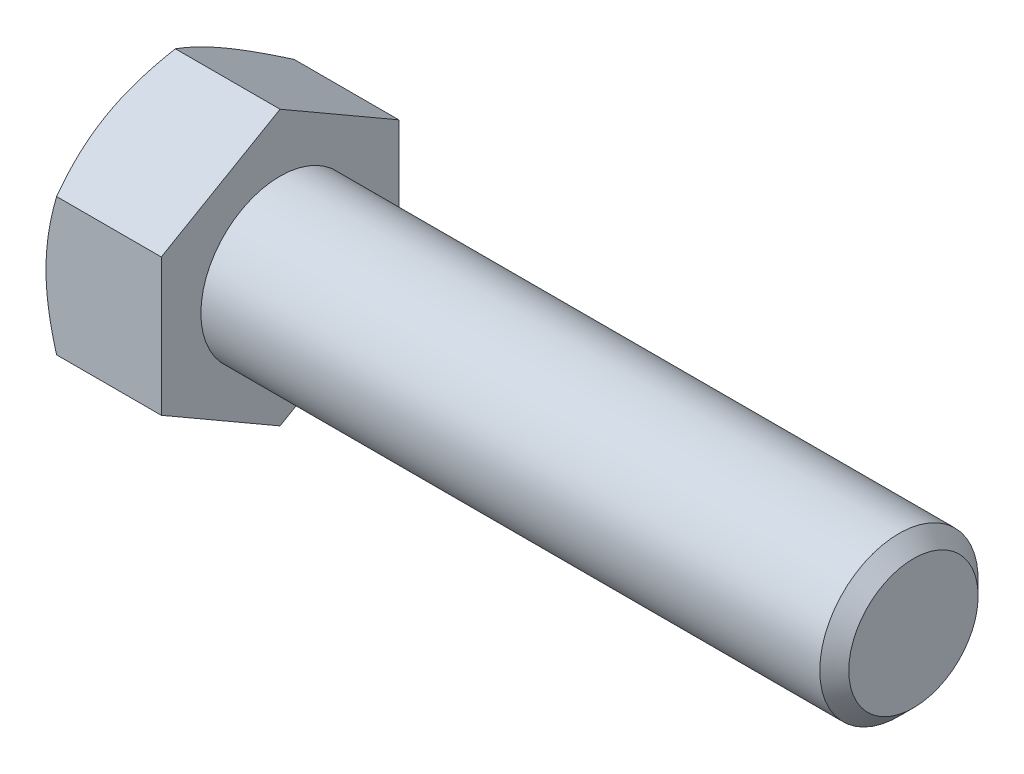
ISO-10303-21;
HEADER;
FILE_DESCRIPTION(('STEP AP214'),'2;1');
FILE_NAME('part.step','',(''),(''),'','','');
FILE_SCHEMA(('AUTOMOTIVE_DESIGN { 1 0 10303 214 1 1 1 1 }'));
ENDSEC;
DATA;
#1=APPLICATION_CONTEXT('core data for automotive mechanical design processes');
#2=APPLICATION_PROTOCOL_DEFINITION('international standard','automotive_design',2000,#1);
#3=PRODUCT_CONTEXT('',#1,'mechanical');
#4=PRODUCT('Part','Part','',(#3));
#5=PRODUCT_RELATED_PRODUCT_CATEGORY('part','',(#4));
#6=PRODUCT_DEFINITION_FORMATION('','',#4);
#7=PRODUCT_DEFINITION_CONTEXT('part definition',#1,'design');
#8=PRODUCT_DEFINITION('design','',#6,#7);
#9=PRODUCT_DEFINITION_SHAPE('','',#8);
#10=(LENGTH_UNIT() NAMED_UNIT(*) SI_UNIT(.MILLI.,.METRE.));
#11=(NAMED_UNIT(*) PLANE_ANGLE_UNIT() SI_UNIT($,.RADIAN.));
#12=(NAMED_UNIT(*) SI_UNIT($,.STERADIAN.) SOLID_ANGLE_UNIT());
#13=UNCERTAINTY_MEASURE_WITH_UNIT(LENGTH_MEASURE(1.E-05),#10,'distance_accuracy_value','');
#14=(GEOMETRIC_REPRESENTATION_CONTEXT(3) GLOBAL_UNCERTAINTY_ASSIGNED_CONTEXT((#13)) GLOBAL_UNIT_ASSIGNED_CONTEXT((#10,
#11,#12)) REPRESENTATION_CONTEXT('',''));
#15=CARTESIAN_POINT('',(0.,0.,0.));
#16=DIRECTION('',(0.,0.,1.));
#17=DIRECTION('',(1.,0.,0.));
#18=AXIS2_PLACEMENT_3D('',#15,#16,#17);
#19=CARTESIAN_POINT('',(9.2456,5.49926131403118,-9.525));
#20=DIRECTION('',(0.,-0.866025403784438,0.5));
#21=DIRECTION('',(0.,-0.5,-0.866025403784438));
#22=AXIS2_PLACEMENT_3D('',#19,#20,#21);
#23=PLANE('',#22);
#24=CARTESIAN_POINT('',(0.850805353685339,10.9986380981162,0.000199999999999971));
#25=CARTESIAN_POINT('',(0.781023201247654,10.8777523132173,-0.209180321357812));
#26=CARTESIAN_POINT('',(0.714408233957875,10.7564158029679,-0.419341321922841));
#27=CARTESIAN_POINT('',(0.588391469790024,10.5127697532954,-0.841348659019071));
#28=CARTESIAN_POINT('',(0.528992045309774,10.3904599078574,-1.05319552558363));
#29=CARTESIAN_POINT('',(0.362766604707593,10.0215595864394,-1.69214962520807));
#30=CARTESIAN_POINT('',(0.268218329918824,9.77351282584137,-2.12177921721667));
#31=CARTESIAN_POINT('',(0.15735162884543,9.40232220358294,-2.76470023426138));
#32=CARTESIAN_POINT('',(0.125769866148953,9.28028730086356,-2.97607088606807));
#33=CARTESIAN_POINT('',(0.0728092531292027,9.03565248016183,-3.39979082482396));
#34=CARTESIAN_POINT('',(0.0514305991810311,8.91305255135051,-3.61214013052951));
#35=CARTESIAN_POINT('',(0.01942397667248,8.66764818787802,-4.03719295646296));
#36=CARTESIAN_POINT('',(0.00878323258549872,8.54484417077186,-4.24989575346438));
#37=CARTESIAN_POINT('',(-0.00152146504907749,8.29912270270345,-4.67549782066928));
#38=CARTESIAN_POINT('',(-0.00118575773535236,8.17620525536319,-4.88839708459929));
#39=CARTESIAN_POINT('',(0.0096988402317776,7.94640807689151,-5.28641747314822));
#40=CARTESIAN_POINT('',(0.0189199445075648,7.83951212670956,-5.4715666899867));
#41=CARTESIAN_POINT('',(0.0454848010115631,7.62597023317657,-5.84143209913029));
#42=CARTESIAN_POINT('',(0.0628291278252528,7.5193243080471,-6.02614825987472));
#43=CARTESIAN_POINT('',(0.126636878025748,7.19979976097279,-6.57958100967286));
#44=CARTESIAN_POINT('',(0.184867121471558,6.98748672019118,-6.94731798341605));
#45=CARTESIAN_POINT('',(0.330443291970776,6.56060850831896,-7.68669273502289));
#46=CARTESIAN_POINT('',(0.418406296346452,6.3460978161353,-8.05823615265175));
#47=CARTESIAN_POINT('',(0.618045797355989,5.92027529884848,-8.79578238759941));
#48=CARTESIAN_POINT('',(0.729675405460148,5.70895802095901,-9.16179464942111));
#49=CARTESIAN_POINT('',(0.850805353685331,5.49914584397734,-9.5252));
#50=B_SPLINE_CURVE_WITH_KNOTS('',3,(#24,#25,#26,#27,#28,#29,#30,#31,#32,#33,#34,#35,#36,#37,#38,
#39,#40,#41,#42,#43,#44,#45,#46,#47,#48,#49),.UNSPECIFIED.,.F.,.F.,(4,2,2,2,2,2,2,2,2,2,2,2,4),
(0.,0.754861746958003,1.50997101692212,3.02340406075151,3.76154608748042,4.49970232035707,
5.23697928598072,5.97423347202913,6.61604550518408,7.25790294292824,8.54252993638602,
9.85564695316764,11.1661863217647),.UNSPECIFIED.);
#51=CARTESIAN_POINT('',(0.850738685968814,10.9985226280624,0.));
#52=VERTEX_POINT('',#51);
#53=CARTESIAN_POINT('',(0.,8.24889197104677,-4.7625));
#54=VERTEX_POINT('',#53);
#55=EDGE_CURVE('E33',#52,#54,#50,.T.);
#56=ORIENTED_EDGE('',*,*,#55,.F.);
#57=DIRECTION('',(-1.,0.,0.));
#58=VECTOR('',#57,1.);
#59=CARTESIAN_POINT('',(9.2456,10.9985226280624,0.));
#60=LINE('',#59,#58);
#61=CARTESIAN_POINT('',(9.2456,10.9985226280624,0.));
#62=VERTEX_POINT('',#61);
#63=EDGE_CURVE('E129',#62,#52,#60,.T.);
#64=ORIENTED_EDGE('',*,*,#63,.F.);
#65=DIRECTION('',(0.,0.5,0.866025403784438));
#66=VECTOR('',#65,1.);
#67=CARTESIAN_POINT('',(9.2456,5.49926131403118,-9.525));
#68=LINE('',#67,#66);
#69=CARTESIAN_POINT('',(9.2456,5.49926131403118,-9.525));
#70=VERTEX_POINT('',#69);
#71=EDGE_CURVE('E214',#70,#62,#68,.T.);
#72=ORIENTED_EDGE('',*,*,#71,.F.);
#73=DIRECTION('',(-1.,0.,0.));
#74=VECTOR('',#73,1.);
#75=CARTESIAN_POINT('',(9.2456,5.49926131403118,-9.525));
#76=LINE('',#75,#74);
#77=CARTESIAN_POINT('',(0.850738685968808,5.49926131403118,-9.525));
#78=VERTEX_POINT('',#77);
#79=EDGE_CURVE('E117',#70,#78,#76,.T.);
#80=ORIENTED_EDGE('',*,*,#79,.T.);
#81=EDGE_CURVE('E111',#54,#78,#50,.T.);
#82=ORIENTED_EDGE('',*,*,#81,.F.);
#83=EDGE_LOOP('',(#56,#64,#72,#80,#82));
#84=FACE_BOUND('',#83,.T.);
#85=ADVANCED_FACE('F17',(#84),#23,.F.);
#86=CARTESIAN_POINT('',(9.2456,10.9985226280624,0.));
#87=DIRECTION('',(0.,-0.866025403784438,-0.5));
#88=DIRECTION('',(0.,0.5,-0.866025403784438));
#89=AXIS2_PLACEMENT_3D('',#86,#87,#88);
#90=PLANE('',#89);
#91=CARTESIAN_POINT('',(0.850805353685331,5.49914584397734,9.5252));
#92=CARTESIAN_POINT('',(0.781023201247651,5.62003162887629,9.31581967864219));
#93=CARTESIAN_POINT('',(0.714408233957875,5.74136813912568,9.10565867807716));
#94=CARTESIAN_POINT('',(0.588391469790027,5.98501418879818,8.68365134098093));
#95=CARTESIAN_POINT('',(0.528992045309778,6.10732403423621,8.47180447441637));
#96=CARTESIAN_POINT('',(0.362766604707597,6.47622435565419,7.83285037479193));
#97=CARTESIAN_POINT('',(0.268218329918826,6.72427111625219,7.40322078278333));
#98=CARTESIAN_POINT('',(0.157351628845434,7.09546173851062,6.76029976573862));
#99=CARTESIAN_POINT('',(0.125769866148958,7.21749664123,6.54892911393194));
#100=CARTESIAN_POINT('',(0.0728092531292075,7.46213146193172,6.12520917517604));
#101=CARTESIAN_POINT('',(0.0514305991810352,7.58473139074305,5.91285986947049));
#102=CARTESIAN_POINT('',(0.0194239766724854,7.83013575421554,5.48780704353704));
#103=CARTESIAN_POINT('',(0.00878323258550612,7.9529397713217,5.27510424653562));
#104=CARTESIAN_POINT('',(-0.00152146504907289,8.1986612393901,4.84950217933073));
#105=CARTESIAN_POINT('',(-0.00118575773535251,8.32157868673037,4.63660291540072));
#106=CARTESIAN_POINT('',(0.00969884023177773,8.55137586520205,4.23858252685179));
#107=CARTESIAN_POINT('',(0.0189199445075688,8.658271815384,4.05343331001331));
#108=CARTESIAN_POINT('',(0.0454848010115698,8.87181370891698,3.68356790086972));
#109=CARTESIAN_POINT('',(0.0628291278252584,8.97845963404645,3.49885174012529));
#110=CARTESIAN_POINT('',(0.126636878025752,9.29798418112076,2.94541899032714));
#111=CARTESIAN_POINT('',(0.184867121471563,9.51029722190237,2.57768201658396));
#112=CARTESIAN_POINT('',(0.330443291970782,9.93717543377459,1.83830726497712));
#113=CARTESIAN_POINT('',(0.418406296346458,10.1516861259583,1.46676384734825));
#114=CARTESIAN_POINT('',(0.618045797355995,10.5775086432451,0.729217612400589));
#115=CARTESIAN_POINT('',(0.729675405460155,10.7888259211345,0.363205350578887));
#116=CARTESIAN_POINT('',(0.850805353685338,10.9986380981162,-0.000199999999998291));
#117=B_SPLINE_CURVE_WITH_KNOTS('',3,(#91,#92,#93,#94,#95,#96,#97,#98,#99,#100,#101,#102,#103,
#104,#105,#106,#107,#108,#109,#110,#111,#112,#113,#114,#115,#116),.UNSPECIFIED.,.F.,.F.,(4,2,2,
2,2,2,2,2,2,2,2,2,4),(0.,0.754861746958003,1.50997101692211,3.0234040607515,3.76154608748042,
4.49970232035706,5.23697928598071,5.97423347202912,6.61604550518407,7.25790294292823,
8.54252993638601,9.85564695316763,11.1661863217647),.UNSPECIFIED.);
#118=CARTESIAN_POINT('',(0.850738685968807,5.49926131403118,9.525));
#119=VERTEX_POINT('',#118);
#120=CARTESIAN_POINT('',(0.,8.24889197104677,4.7625));
#121=VERTEX_POINT('',#120);
#122=EDGE_CURVE('E40',#119,#121,#117,.T.);
#123=ORIENTED_EDGE('',*,*,#122,.F.);
#124=DIRECTION('',(-1.,0.,0.));
#125=VECTOR('',#124,1.);
#126=CARTESIAN_POINT('',(9.2456,5.49926131403118,9.525));
#127=LINE('',#126,#125);
#128=CARTESIAN_POINT('',(9.2456,5.49926131403118,9.525));
#129=VERTEX_POINT('',#128);
#130=EDGE_CURVE('E127',#129,#119,#127,.T.);
#131=ORIENTED_EDGE('',*,*,#130,.F.);
#132=DIRECTION('',(0.,-0.5,0.866025403784438));
#133=VECTOR('',#132,1.);
#134=CARTESIAN_POINT('',(9.2456,10.9985226280624,0.));
#135=LINE('',#134,#133);
#136=EDGE_CURVE('E212',#62,#129,#135,.T.);
#137=ORIENTED_EDGE('',*,*,#136,.F.);
#138=ORIENTED_EDGE('',*,*,#63,.T.);
#139=EDGE_CURVE('E144',#121,#52,#117,.T.);
#140=ORIENTED_EDGE('',*,*,#139,.F.);
#141=EDGE_LOOP('',(#123,#131,#137,#138,#140));
#142=FACE_BOUND('',#141,.T.);
#143=ADVANCED_FACE('F150',(#142),#90,.F.);
#144=CARTESIAN_POINT('',(9.2456,5.49926131403118,9.525));
#145=DIRECTION('',(0.,0.,-1.));
#146=DIRECTION('',(-1.,0.,0.));
#147=AXIS2_PLACEMENT_3D('',#144,#145,#146);
#148=PLANE('',#147);
#149=CARTESIAN_POINT('',(4.652978620201,-14.7810115366526,9.525));
#150=CARTESIAN_POINT('',(4.55200114697974,-14.5729402848548,9.525));
#151=CARTESIAN_POINT('',(4.451526578525,-14.3646250845143,9.525));
#152=CARTESIAN_POINT('',(4.25169715270385,-13.9474558848886,9.525));
#153=CARTESIAN_POINT('',(4.15234230655459,-13.7386018802315,9.525));
#154=CARTESIAN_POINT('',(3.85610205085237,-13.1110997604408,9.525));
#155=CARTESIAN_POINT('',(3.66107082946322,-12.6915729928092,9.525));
#156=CARTESIAN_POINT('',(3.27608312845876,-11.8474364819289,9.525));
#157=CARTESIAN_POINT('',(3.08615996520331,-11.4228115070931,9.525));
#158=CARTESIAN_POINT('',(2.71407238167634,-10.5701875182868,9.525));
#159=CARTESIAN_POINT('',(2.53190759510788,-10.1421886647409,9.525));
#160=CARTESIAN_POINT('',(2.1717318042123,-9.26840827793763,9.525));
#161=CARTESIAN_POINT('',(1.99403865760543,-8.8224950006504,9.525));
#162=CARTESIAN_POINT('',(1.65207801715253,-7.9254565440483,9.525));
#163=CARTESIAN_POINT('',(1.48781202814777,-7.47433078699668,9.525));
#164=CARTESIAN_POINT('',(1.17701101312695,-6.56698486643263,9.525));
#165=CARTESIAN_POINT('',(1.0304402073799,-6.11077709183235,9.525));
#166=CARTESIAN_POINT('',(0.7597239804624,-5.19183461770946,9.525));
#167=CARTESIAN_POINT('',(0.635571508908769,-4.72910201971935,9.525));
#168=CARTESIAN_POINT('',(0.416296039044827,-3.79927533749825,9.525));
#169=CARTESIAN_POINT('',(0.321019170056998,-3.33221854628569,9.525));
#170=CARTESIAN_POINT('',(0.203895327456021,-2.62737339603034,9.525));
#171=CARTESIAN_POINT('',(0.169151073901595,-2.39169815065083,9.525));
#172=CARTESIAN_POINT('',(0.108940898325769,-1.91917305353183,9.525));
#173=CARTESIAN_POINT('',(0.0834740799106718,-1.68232331751526,9.525));
#174=CARTESIAN_POINT('',(0.0426462139382911,-1.21086692666172,9.525));
#175=CARTESIAN_POINT('',(0.0271575476697088,-0.976271367216098,9.525));
#176=CARTESIAN_POINT('',(0.00611497588533458,-0.506635508477952,9.525));
#177=CARTESIAN_POINT('',(0.000560905150695468,-0.271595216646697,9.525));
#178=CARTESIAN_POINT('',(-0.0004799671317914,0.198511625361329,9.525));
#179=CARTESIAN_POINT('',(0.00403333600034556,0.433578175785724,9.525));
#180=CARTESIAN_POINT('',(0.0230169602197958,0.903311845567765,9.525));
#181=CARTESIAN_POINT('',(0.0374877771856483,1.13797894444949,9.525));
#182=CARTESIAN_POINT('',(0.0838926002328699,1.70156520102241,9.525));
#183=CARTESIAN_POINT('',(0.120529196491428,2.03010533257161,9.525));
#184=CARTESIAN_POINT('',(0.211324091565227,2.68473880457706,9.525));
#185=CARTESIAN_POINT('',(0.265484757377356,3.01083180840528,9.525));
#186=CARTESIAN_POINT('',(0.451380100896851,3.98506326209961,9.525));
#187=CARTESIAN_POINT('',(0.6064950202191,4.62879899939553,9.525));
#188=CARTESIAN_POINT('',(0.875429330956873,5.59158230732313,9.525));
#189=CARTESIAN_POINT('',(0.972405254059027,5.91562142468818,9.525));
#190=CARTESIAN_POINT('',(1.1764087393435,6.56055109397582,9.525));
#191=CARTESIAN_POINT('',(1.28343637307407,6.88144162346874,9.525));
#192=CARTESIAN_POINT('',(1.50582732440541,7.52017825999873,9.525));
#193=CARTESIAN_POINT('',(1.62118794476214,7.83802531476306,9.525));
#194=CARTESIAN_POINT('',(1.85888923263679,8.47108431720178,9.525));
#195=CARTESIAN_POINT('',(1.98122977973552,8.78629631022932,9.525));
#196=CARTESIAN_POINT('',(2.30063477459308,9.5871627431034,9.525));
#197=CARTESIAN_POINT('',(2.50178184900059,10.0711868007296,9.525));
#198=CARTESIAN_POINT('',(2.91473175900993,11.0346830906917,9.525));
#199=CARTESIAN_POINT('',(3.12653548923491,11.5141549368409,9.525));
#200=CARTESIAN_POINT('',(3.55844219486127,12.4695072075479,9.525));
#201=CARTESIAN_POINT('',(3.77854763045354,12.9453865165195,9.525));
#202=CARTESIAN_POINT('',(4.22520690131799,13.8940827737157,9.525));
#203=CARTESIAN_POINT('',(4.45176054207863,14.3668998137873,9.525));
#204=CARTESIAN_POINT('',(4.91030379081788,15.31066754278,9.525));
#205=CARTESIAN_POINT('',(5.14230026383006,15.7816148898186,9.525));
#206=CARTESIAN_POINT('',(5.61043419198851,16.7214473380242,9.525));
#207=CARTESIAN_POINT('',(5.84657167244608,17.190332426564,9.525));
#208=CARTESIAN_POINT('',(6.32217781208354,18.1263065899709,9.525));
#209=CARTESIAN_POINT('',(6.56164589066585,18.5933959601917,9.525));
#210=CARTESIAN_POINT('',(7.04336394052912,19.5261387749102,9.525));
#211=CARTESIAN_POINT('',(7.2856139225859,19.9917922138368,9.525));
#212=CARTESIAN_POINT('',(7.96929589667508,21.2980525732429,9.525));
#213=CARTESIAN_POINT('',(8.41334550528857,22.137289288128,9.525));
#214=CARTESIAN_POINT('',(9.30698696570739,23.81285124024,9.525));
#215=CARTESIAN_POINT('',(9.75657908064913,24.6491763367986,9.525));
#216=CARTESIAN_POINT('',(10.6586387715906,26.3171534675353,9.525));
#217=CARTESIAN_POINT('',(11.111094298492,27.1488120222569,9.525));
#218=CARTESIAN_POINT('',(11.7921739160347,28.394953533384,9.525));
#219=CARTESIAN_POINT('',(12.0195924712892,28.8100962856008,9.525));
#220=CARTESIAN_POINT('',(12.4751463020887,29.6399876727052,9.525));
#221=CARTESIAN_POINT('',(12.7032815766791,30.0547363081167,9.525));
#222=CARTESIAN_POINT('',(12.9317320980145,30.4693112732241,9.525));
#223=B_SPLINE_CURVE_WITH_KNOTS('',3,(#149,#150,#151,#152,#153,#154,#155,#156,#157,#158,#159,
#160,#161,#162,#163,#164,#165,#166,#167,#168,#169,#170,#171,#172,#173,#174,#175,#176,#177,#178,
#179,#180,#181,#182,#183,#184,#185,#186,#187,#188,#189,#190,#191,#192,#193,#194,#195,#196,#197,
#198,#199,#200,#201,#202,#203,#204,#205,#206,#207,#208,#209,#210,#211,#212,#213,#214,#215,#216,
#217,#218,#219,#220,#221,#222),.UNSPECIFIED.,.F.,.F.,(4,2,2,2,2,2,2,2,2,2,2,2,2,2,2,2,2,2,2,2,2,
2,2,2,2,2,2,2,2,2,2,2,2,2,2,2,4),(0.,0.693836530044209,1.38768000463458,2.77557197297935,
4.17100213114403,5.56636633354267,7.00624082823087,8.44627647542749,9.88334978435085,
11.3199703553045,12.748795200913,13.4633089947651,14.177753733363,14.882869257303,
15.5879730545998,16.2930841835603,16.9982304291964,17.9894005549206,18.9807046150987,
20.9643780182785,21.979010564481,22.9936503334043,24.0079631400216,25.0222584527869,
26.5945433127102,28.1669603864419,29.7398471611297,31.3126865395143,32.8876294963396,
34.4625820831342,36.0372634785707,37.6119509756548,40.460336959425,43.3088586981742,
46.1491565485714,47.569213896597,48.9892693539119),.UNSPECIFIED.);
#224=CARTESIAN_POINT('',(0.850738685968817,-5.49926131403121,9.525));
#225=VERTEX_POINT('',#224);
#226=CARTESIAN_POINT('',(0.,0.,9.525));
#227=VERTEX_POINT('',#226);
#228=EDGE_CURVE('E224',#225,#227,#223,.T.);
#229=ORIENTED_EDGE('',*,*,#228,.F.);
#230=DIRECTION('',(-1.,0.,0.));
#231=VECTOR('',#230,1.);
#232=CARTESIAN_POINT('',(9.2456,-5.49926131403121,9.525));
#233=LINE('',#232,#231);
#234=CARTESIAN_POINT('',(9.2456,-5.49926131403121,9.525));
#235=VERTEX_POINT('',#234);
#236=EDGE_CURVE('E119',#235,#225,#233,.T.);
#237=ORIENTED_EDGE('',*,*,#236,.F.);
#238=DIRECTION('',(0.,-1.,0.));
#239=VECTOR('',#238,1.);
#240=CARTESIAN_POINT('',(9.2456,5.49926131403118,9.525));
#241=LINE('',#240,#239);
#242=EDGE_CURVE('E208',#129,#235,#241,.T.);
#243=ORIENTED_EDGE('',*,*,#242,.F.);
#244=ORIENTED_EDGE('',*,*,#130,.T.);
#245=EDGE_CURVE('E166',#227,#119,#223,.T.);
#246=ORIENTED_EDGE('',*,*,#245,.F.);
#247=EDGE_LOOP('',(#229,#237,#243,#244,#246));
#248=FACE_BOUND('',#247,.T.);
#249=ADVANCED_FACE('F230',(#248),#148,.F.);
#250=CARTESIAN_POINT('',(9.2456,-10.9985226280624,0.));
#251=DIRECTION('',(0.,0.866025403784438,-0.5));
#252=DIRECTION('',(0.,0.5,0.866025403784438));
#253=AXIS2_PLACEMENT_3D('',#250,#251,#252);
#254=PLANE('',#253);
#255=CARTESIAN_POINT('',(0.850805353685355,-10.9986380981162,-0.000200000000000202));
#256=CARTESIAN_POINT('',(0.78102320124767,-10.8777523132173,0.209180321357815));
#257=CARTESIAN_POINT('',(0.714408233957891,-10.7564158029679,0.419341321922845));
#258=CARTESIAN_POINT('',(0.58839146979004,-10.5127697532954,0.841348659019077));
#259=CARTESIAN_POINT('',(0.528992045309789,-10.3904599078574,1.05319552558364));
#260=CARTESIAN_POINT('',(0.362766604707608,-10.0215595864394,1.69214962520808));
#261=CARTESIAN_POINT('',(0.268218329918838,-9.77351282584139,2.12177921721669));
#262=CARTESIAN_POINT('',(0.157351628845445,-9.40232220358296,2.76470023426139));
#263=CARTESIAN_POINT('',(0.125769866148968,-9.28028730086358,2.97607088606808));
#264=CARTESIAN_POINT('',(0.0728092531292174,-9.03565248016185,3.39979082482397));
#265=CARTESIAN_POINT('',(0.0514305991810452,-8.91305255135052,3.61214013052952));
#266=CARTESIAN_POINT('',(0.0194239766724941,-8.66764818787804,4.03719295646297));
#267=CARTESIAN_POINT('',(0.00878323258551323,-8.54484417077188,4.2498957534644));
#268=CARTESIAN_POINT('',(-0.00152146504906245,-8.29912270270347,4.67549782066929));
#269=CARTESIAN_POINT('',(-0.00118575773533726,-8.17620525536321,4.8883970845993));
#270=CARTESIAN_POINT('',(0.00969884023179252,-7.94640807689152,5.28641747314823));
#271=CARTESIAN_POINT('',(0.0189199445075795,-7.83951212670958,5.47156668998671));
#272=CARTESIAN_POINT('',(0.0454848010115774,-7.6259702331766,5.8414320991303));
#273=CARTESIAN_POINT('',(0.0628291278252671,-7.51932430804712,6.02614825987473));
#274=CARTESIAN_POINT('',(0.126636878025762,-7.19979976097281,6.57958100967287));
#275=CARTESIAN_POINT('',(0.184867121471572,-6.98748672019121,6.94731798341606));
#276=CARTESIAN_POINT('',(0.330443291970789,-6.56060850831899,7.68669273502289));
#277=CARTESIAN_POINT('',(0.418406296346464,-6.34609781613533,8.05823615265176));
#278=CARTESIAN_POINT('',(0.618045797356,-5.9202752988485,8.79578238759942));
#279=CARTESIAN_POINT('',(0.729675405460159,-5.70895802095904,9.16179464942112));
#280=CARTESIAN_POINT('',(0.850805353685341,-5.49914584397737,9.5252));
#281=B_SPLINE_CURVE_WITH_KNOTS('',3,(#255,#256,#257,#258,#259,#260,#261,#262,#263,#264,#265,
#266,#267,#268,#269,#270,#271,#272,#273,#274,#275,#276,#277,#278,#279,#280),.UNSPECIFIED.,.F.,
.F.,(4,2,2,2,2,2,2,2,2,2,2,2,4),(0.,0.754861746958005,1.50997101692212,3.02340406075152,
3.76154608748043,4.49970232035708,5.23697928598073,5.97423347202915,6.61604550518409,
7.25790294292825,8.54252993638602,9.85564695316764,11.1661863217647),.UNSPECIFIED.);
#282=CARTESIAN_POINT('',(0.850738685968831,-10.9985226280624,0.));
#283=VERTEX_POINT('',#282);
#284=CARTESIAN_POINT('',(0.,-8.24889197104677,4.7625));
#285=VERTEX_POINT('',#284);
#286=EDGE_CURVE('E152',#283,#285,#281,.T.);
#287=ORIENTED_EDGE('',*,*,#286,.F.);
#288=DIRECTION('',(-1.,0.,0.));
#289=VECTOR('',#288,1.);
#290=CARTESIAN_POINT('',(9.2456,-10.9985226280624,0.));
#291=LINE('',#290,#289);
#292=CARTESIAN_POINT('',(9.2456,-10.9985226280624,0.));
#293=VERTEX_POINT('',#292);
#294=EDGE_CURVE('E116',#293,#283,#291,.T.);
#295=ORIENTED_EDGE('',*,*,#294,.F.);
#296=DIRECTION('',(0.,-0.5,-0.866025403784438));
#297=VECTOR('',#296,1.);
#298=CARTESIAN_POINT('',(9.2456,-10.9985226280624,0.));
#299=LINE('',#298,#297);
#300=EDGE_CURVE('E206',#235,#293,#299,.T.);
#301=ORIENTED_EDGE('',*,*,#300,.F.);
#302=ORIENTED_EDGE('',*,*,#236,.T.);
#303=EDGE_CURVE('E154',#285,#225,#281,.T.);
#304=ORIENTED_EDGE('',*,*,#303,.F.);
#305=EDGE_LOOP('',(#287,#295,#301,#302,#304));
#306=FACE_BOUND('',#305,.T.);
#307=ADVANCED_FACE('F202',(#306),#254,.F.);
#308=CARTESIAN_POINT('',(9.2456,-5.4992613140312,-9.525));
#309=DIRECTION('',(0.,0.866025403784438,0.5));
#310=DIRECTION('',(0.,-0.5,0.866025403784438));
#311=AXIS2_PLACEMENT_3D('',#308,#309,#310);
#312=PLANE('',#311);
#313=CARTESIAN_POINT('',(0.850805353685339,-5.49914584397736,-9.5252));
#314=CARTESIAN_POINT('',(0.781023201247656,-5.62003162887631,-9.31581967864218));
#315=CARTESIAN_POINT('',(0.714408233957878,-5.74136813912569,-9.10565867807715));
#316=CARTESIAN_POINT('',(0.588391469790029,-5.9850141887982,-8.68365134098092));
#317=CARTESIAN_POINT('',(0.528992045309779,-6.10732403423622,-8.47180447441636));
#318=CARTESIAN_POINT('',(0.362766604707598,-6.47622435565421,-7.83285037479192));
#319=CARTESIAN_POINT('',(0.268218329918828,-6.72427111625221,-7.40322078278332));
#320=CARTESIAN_POINT('',(0.157351628845436,-7.09546173851063,-6.76029976573861));
#321=CARTESIAN_POINT('',(0.12576986614896,-7.21749664123001,-6.54892911393192));
#322=CARTESIAN_POINT('',(0.0728092531292107,-7.46213146193174,-6.12520917517603));
#323=CARTESIAN_POINT('',(0.0514305991810387,-7.58473139074307,-5.91285986947048));
#324=CARTESIAN_POINT('',(0.0194239766724879,-7.83013575421556,-5.48780704353703));
#325=CARTESIAN_POINT('',(0.00878323258550723,-7.95293977132171,-5.27510424653561));
#326=CARTESIAN_POINT('',(-0.00152146504906597,-8.19866123939013,-4.84950217933071));
#327=CARTESIAN_POINT('',(-0.00118575773533842,-8.3215786867304,-4.63660291540071));
#328=CARTESIAN_POINT('',(0.00969884023179119,-8.55137586520208,-4.23858252685178));
#329=CARTESIAN_POINT('',(0.0189199445075763,-8.65827181538402,-4.0534333100133));
#330=CARTESIAN_POINT('',(0.0454848010115732,-8.871813708917,-3.6835679008697));
#331=CARTESIAN_POINT('',(0.0628291278252637,-8.97845963404647,-3.49885174012527));
#332=CARTESIAN_POINT('',(0.126636878025761,-9.29798418112079,-2.94541899032713));
#333=CARTESIAN_POINT('',(0.184867121471571,-9.51029722190239,-2.57768201658395));
#334=CARTESIAN_POINT('',(0.330443291970789,-9.93717543377461,-1.8383072649771));
#335=CARTESIAN_POINT('',(0.418406296346465,-10.1516861259583,-1.46676384734824));
#336=CARTESIAN_POINT('',(0.618045797356005,-10.5775086432451,-0.72921761240058));
#337=CARTESIAN_POINT('',(0.729675405460167,-10.7888259211346,-0.363205350578882));
#338=CARTESIAN_POINT('',(0.850805353685355,-10.9986380981162,0.000199999999999635));
#339=B_SPLINE_CURVE_WITH_KNOTS('',3,(#313,#314,#315,#316,#317,#318,#319,#320,#321,#322,#323,
#324,#325,#326,#327,#328,#329,#330,#331,#332,#333,#334,#335,#336,#337,#338),.UNSPECIFIED.,.F.,
.F.,(4,2,2,2,2,2,2,2,2,2,2,2,4),(0.,0.754861746958003,1.50997101692212,3.02340406075151,
3.76154608748043,4.49970232035707,5.23697928598073,5.97423347202913,6.61604550518408,
7.25790294292824,8.54252993638602,9.85564695316764,11.1661863217647),.UNSPECIFIED.);
#340=CARTESIAN_POINT('',(0.850738685968814,-5.4992613140312,-9.525));
#341=VERTEX_POINT('',#340);
#342=CARTESIAN_POINT('',(0.,-8.24889197104677,-4.7625));
#343=VERTEX_POINT('',#342);
#344=EDGE_CURVE('E93',#341,#343,#339,.T.);
#345=ORIENTED_EDGE('',*,*,#344,.F.);
#346=DIRECTION('',(-1.,0.,0.));
#347=VECTOR('',#346,1.);
#348=CARTESIAN_POINT('',(9.2456,-5.4992613140312,-9.525));
#349=LINE('',#348,#347);
#350=CARTESIAN_POINT('',(9.2456,-5.4992613140312,-9.525));
#351=VERTEX_POINT('',#350);
#352=EDGE_CURVE('E107',#351,#341,#349,.T.);
#353=ORIENTED_EDGE('',*,*,#352,.F.);
#354=DIRECTION('',(0.,0.5,-0.866025403784438));
#355=VECTOR('',#354,1.);
#356=CARTESIAN_POINT('',(9.2456,-5.4992613140312,-9.525));
#357=LINE('',#356,#355);
#358=EDGE_CURVE('E204',#293,#351,#357,.T.);
#359=ORIENTED_EDGE('',*,*,#358,.F.);
#360=ORIENTED_EDGE('',*,*,#294,.T.);
#361=EDGE_CURVE('E110',#343,#283,#339,.T.);
#362=ORIENTED_EDGE('',*,*,#361,.F.);
#363=EDGE_LOOP('',(#345,#353,#359,#360,#362));
#364=FACE_BOUND('',#363,.T.);
#365=ADVANCED_FACE('F105',(#364),#312,.F.);
#366=CARTESIAN_POINT('',(9.2456,5.49926131403118,-9.525));
#367=DIRECTION('',(0.,0.,1.));
#368=DIRECTION('',(0.,-1.,0.));
#369=AXIS2_PLACEMENT_3D('',#366,#367,#368);
#370=PLANE('',#369);
#371=CARTESIAN_POINT('',(4.65297862037688,-14.781011537015,-9.525));
#372=CARTESIAN_POINT('',(4.55200114715194,-14.5729402852111,-9.525));
#373=CARTESIAN_POINT('',(4.45152657869351,-14.3646250848645,-9.525));
#374=CARTESIAN_POINT('',(4.25169715286501,-13.9474558852266,-9.525));
#375=CARTESIAN_POINT('',(4.15234230671207,-13.7386018805634,-9.525));
#376=CARTESIAN_POINT('',(3.85610205099884,-13.1110997607544,-9.525));
#377=CARTESIAN_POINT('',(3.66107082960237,-12.6915729931106,-9.525));
#378=CARTESIAN_POINT('',(3.27608312858326,-11.8474364822056,-9.525));
#379=CARTESIAN_POINT('',(3.08615996532048,-11.4228115073574,-9.525));
#380=CARTESIAN_POINT('',(2.71407238177897,-10.5701875185262,-9.525));
#381=CARTESIAN_POINT('',(2.53190759520331,-10.1421886649677,-9.525));
#382=CARTESIAN_POINT('',(2.17173180429314,-9.26840827813855,-9.525));
#383=CARTESIAN_POINT('',(1.99403865767891,-8.82249500083789,-9.525));
#384=CARTESIAN_POINT('',(1.65207801721168,-7.92545654420872,-9.525));
#385=CARTESIAN_POINT('',(1.48781202819996,-7.47433078714345,-9.525));
#386=CARTESIAN_POINT('',(1.17701101316588,-6.56698486655185,-9.525));
#387=CARTESIAN_POINT('',(1.03044020741254,-6.11077709193766,-9.525));
#388=CARTESIAN_POINT('',(0.759723980483507,-5.19183461778659,-9.525));
#389=CARTESIAN_POINT('',(0.635571508924628,-4.7291020197822,-9.525));
#390=CARTESIAN_POINT('',(0.416296039050122,-3.79927533752507,-9.525));
#391=CARTESIAN_POINT('',(0.321019170057397,-3.33221854629067,-9.525));
#392=CARTESIAN_POINT('',(0.203895327451555,-2.62737339600217,-9.525));
#393=CARTESIAN_POINT('',(0.16915107389592,-2.39169815061155,-9.525));
#394=CARTESIAN_POINT('',(0.108940898318592,-1.91917305347024,-9.525));
#395=CARTESIAN_POINT('',(0.0834740799032018,-1.68232331744248,-9.525));
#396=CARTESIAN_POINT('',(0.0426462139312217,-1.21086692656677,-9.525));
#397=CARTESIAN_POINT('',(0.0271575476633157,-0.976271367110179,-9.525));
#398=CARTESIAN_POINT('',(0.00611497588125667,-0.506635508350125,-9.525));
#399=CARTESIAN_POINT('',(0.000560905148256367,-0.271595216507931,-9.525));
#400=CARTESIAN_POINT('',(-0.000479967130014341,0.198511625521891,-9.525));
#401=CARTESIAN_POINT('',(0.00403333600470016,0.43357817595714,-9.525));
#402=CARTESIAN_POINT('',(0.0230169602301712,0.903311845760749,-9.525));
#403=CARTESIAN_POINT('',(0.037487777199467,1.13797894465318,-9.525));
#404=CARTESIAN_POINT('',(0.0838926002551648,1.70156520124285,-9.525));
#405=CARTESIAN_POINT('',(0.120529196518619,2.03010533279804,-9.525));
#406=CARTESIAN_POINT('',(0.211324091602473,2.68473880481518,-9.525));
#407=CARTESIAN_POINT('',(0.265484757419762,3.01083180864913,-9.525));
#408=CARTESIAN_POINT('',(0.451380100954848,3.98506326236031,-9.525));
#409=CARTESIAN_POINT('',(0.606495020287634,4.62879899966704,-9.525));
#410=CARTESIAN_POINT('',(0.875429331040971,5.59158230761081,-9.525));
#411=CARTESIAN_POINT('',(0.97240525414835,5.91562142498137,-9.525));
#412=CARTESIAN_POINT('',(1.17640873944312,6.56055109427995,-9.525));
#413=CARTESIAN_POINT('',(1.28343637317876,6.88144162377831,-9.525));
#414=CARTESIAN_POINT('',(1.50582732452007,7.52017826031916,-9.525));
#415=CARTESIAN_POINT('',(1.6211879448817,7.83802531508889,-9.525));
#416=CARTESIAN_POINT('',(1.85888923276598,8.47108431753843,-9.525));
#417=CARTESIAN_POINT('',(1.98122977986944,8.78629631057138,-9.525));
#418=CARTESIAN_POINT('',(2.30063477473474,9.58716274344887,-9.525));
#419=CARTESIAN_POINT('',(2.50178184914485,10.0711868010732,-9.525));
#420=CARTESIAN_POINT('',(2.9147317591587,11.0346830910319,-9.525));
#421=CARTESIAN_POINT('',(3.12653548938559,11.5141549371794,-9.525));
#422=CARTESIAN_POINT('',(3.55844219501525,12.4695072078833,-9.525));
#423=CARTESIAN_POINT('',(3.7785476306089,12.9453865168534,-9.525));
#424=CARTESIAN_POINT('',(4.22520690147576,13.8940827740468,-9.525));
#425=CARTESIAN_POINT('',(4.45176054223741,14.3668998141172,-9.525));
#426=CARTESIAN_POINT('',(4.91030379097837,15.3106675431073,-9.525));
#427=CARTESIAN_POINT('',(5.14230026399126,15.7816148901446,-9.525));
#428=CARTESIAN_POINT('',(5.61043419215089,16.7214473383478,-9.525));
#429=CARTESIAN_POINT('',(5.84657167260895,17.1903324268864,-9.525));
#430=CARTESIAN_POINT('',(6.32217781224723,18.1263065902911,-9.525));
#431=CARTESIAN_POINT('',(6.56164589082987,18.5933959605109,-9.525));
#432=CARTESIAN_POINT('',(7.04336394069366,19.5261387752273,-9.525));
#433=CARTESIAN_POINT('',(7.28561392275064,19.9917922141529,-9.525));
#434=CARTESIAN_POINT('',(7.96929589684111,21.2980525735578,-9.525));
#435=CARTESIAN_POINT('',(8.41334550545559,22.1372892884429,-9.525));
#436=CARTESIAN_POINT('',(9.30698696587618,23.8128512405548,-9.525));
#437=CARTESIAN_POINT('',(9.7565790808187,24.6491763371134,-9.525));
#438=CARTESIAN_POINT('',(10.6586387717617,26.3171534678505,-9.525));
#439=CARTESIAN_POINT('',(11.1110942986639,27.1488120225724,-9.525));
#440=CARTESIAN_POINT('',(11.7921739162078,28.3949535337001,-9.525));
#441=CARTESIAN_POINT('',(12.0195924714626,28.8100962859172,-9.525));
#442=CARTESIAN_POINT('',(12.4751463022628,29.639987673022,-9.525));
#443=CARTESIAN_POINT('',(12.7032815768536,30.0547363084337,-9.525));
#444=CARTESIAN_POINT('',(12.9317320981892,30.4693112735413,-9.525));
#445=B_SPLINE_CURVE_WITH_KNOTS('',3,(#371,#372,#373,#374,#375,#376,#377,#378,#379,#380,#381,
#382,#383,#384,#385,#386,#387,#388,#389,#390,#391,#392,#393,#394,#395,#396,#397,#398,#399,#400,
#401,#402,#403,#404,#405,#406,#407,#408,#409,#410,#411,#412,#413,#414,#415,#416,#417,#418,#419,
#420,#421,#422,#423,#424,#425,#426,#427,#428,#429,#430,#431,#432,#433,#434,#435,#436,#437,#438,
#439,#440,#441,#442,#443,#444),.UNSPECIFIED.,.F.,.F.,(4,2,2,2,2,2,2,2,2,2,2,2,2,2,2,2,2,2,2,2,2,
2,2,2,2,2,2,2,2,2,2,2,2,2,2,2,4),(0.,0.693836530065472,1.38768000467711,2.77557197306441,
4.17100213127209,5.56636633371373,7.00624082844753,8.44627647568975,9.88334978465857,
11.3199703556576,12.7487952013331,13.4633089952187,14.17775373385,14.8828692578227,
15.5879730551522,16.2930841841453,16.9982304298141,17.9894005555578,18.9807046157553,
20.9643780189742,21.979010565197,22.9936503341406,24.0079631407782,25.0222584535637,
26.5945433134849,28.1669603872144,29.7398471619,31.3126865402824,32.8876294971052,
34.4625820838974,36.0372634793314,37.6119509764132,40.4603369601845,43.3088586989349,
46.1491565493342,47.5692138973609,48.9892693546768),.UNSPECIFIED.);
#446=CARTESIAN_POINT('',(0.,0.,-9.525));
#447=VERTEX_POINT('',#446);
#448=EDGE_CURVE('E99',#78,#447,#445,.F.);
#449=ORIENTED_EDGE('',*,*,#448,.F.);
#450=ORIENTED_EDGE('',*,*,#79,.F.);
#451=DIRECTION('',(0.,1.,0.));
#452=VECTOR('',#451,1.);
#453=CARTESIAN_POINT('',(9.2456,5.49926131403118,-9.525));
#454=LINE('',#453,#452);
#455=EDGE_CURVE('E115',#351,#70,#454,.T.);
#456=ORIENTED_EDGE('',*,*,#455,.F.);
#457=ORIENTED_EDGE('',*,*,#352,.T.);
#458=EDGE_CURVE('E90',#447,#341,#445,.F.);
#459=ORIENTED_EDGE('',*,*,#458,.F.);
#460=EDGE_LOOP('',(#449,#450,#456,#457,#459));
#461=FACE_BOUND('',#460,.T.);
#462=ADVANCED_FACE('F113',(#461),#370,.F.);
#463=CARTESIAN_POINT('',(9.2456,0.,-19.05));
#464=DIRECTION('',(1.,0.,0.));
#465=DIRECTION('',(0.,0.,-1.));
#466=AXIS2_PLACEMENT_3D('',#463,#464,#465);
#467=PLANE('',#466);
#468=ORIENTED_EDGE('',*,*,#71,.T.);
#469=ORIENTED_EDGE('',*,*,#136,.T.);
#470=ORIENTED_EDGE('',*,*,#242,.T.);
#471=ORIENTED_EDGE('',*,*,#300,.T.);
#472=ORIENTED_EDGE('',*,*,#358,.T.);
#473=ORIENTED_EDGE('',*,*,#455,.T.);
#474=EDGE_LOOP('',(#468,#469,#470,#471,#472,#473));
#475=FACE_BOUND('',#474,.T.);
#476=CARTESIAN_POINT('',(9.2456,0.,0.));
#477=DIRECTION('',(1.,0.,0.));
#478=DIRECTION('',(0.,0.,-1.));
#479=AXIS2_PLACEMENT_3D('',#476,#477,#478);
#480=CIRCLE('',#479,6.35);
#481=CARTESIAN_POINT('',(9.2456,0.,-6.35));
#482=VERTEX_POINT('',#481);
#483=EDGE_CURVE('E217',#482,#482,#480,.F.);
#484=ORIENTED_EDGE('',*,*,#483,.T.);
#485=EDGE_LOOP('',(#484));
#486=FACE_BOUND('',#485,.T.);
#487=ADVANCED_FACE('F232',(#475,#486),#467,.T.);
#488=CARTESIAN_POINT('',(0.,0.,0.));
#489=DIRECTION('',(-1.,0.,0.));
#490=DIRECTION('',(0.,0.,1.));
#491=AXIS2_PLACEMENT_3D('',#488,#489,#490);
#492=CYLINDRICAL_SURFACE('',#491,6.35);
#493=ORIENTED_EDGE('',*,*,#483,.F.);
#494=EDGE_LOOP('',(#493));
#495=FACE_BOUND('',#494,.T.);
#496=CARTESIAN_POINT('',(58.88228,0.,0.));
#497=DIRECTION('',(-1.,0.,0.));
#498=DIRECTION('',(0.,0.,1.));
#499=AXIS2_PLACEMENT_3D('',#496,#497,#498);
#500=CIRCLE('',#499,6.35);
#501=CARTESIAN_POINT('',(58.88228,0.,6.35));
#502=VERTEX_POINT('',#501);
#503=EDGE_CURVE('E220',#502,#502,#500,.T.);
#504=ORIENTED_EDGE('',*,*,#503,.T.);
#505=EDGE_LOOP('',(#504));
#506=FACE_BOUND('',#505,.T.);
#507=ADVANCED_FACE('F269',(#495,#506),#492,.T.);
#508=CARTESIAN_POINT('',(60.0456,0.,0.));
#509=DIRECTION('',(-1.,0.,0.));
#510=DIRECTION('',(0.,0.,1.));
#511=AXIS2_PLACEMENT_3D('',#508,#509,#510);
#512=CONICAL_SURFACE('',#511,5.18668,0.785398163397446);
#513=ORIENTED_EDGE('',*,*,#503,.F.);
#514=EDGE_LOOP('',(#513));
#515=FACE_BOUND('',#514,.T.);
#516=CARTESIAN_POINT('',(60.0456,0.,0.));
#517=DIRECTION('',(-1.,0.,0.));
#518=DIRECTION('',(0.,0.,1.));
#519=AXIS2_PLACEMENT_3D('',#516,#517,#518);
#520=CIRCLE('',#519,5.18668);
#521=CARTESIAN_POINT('',(60.0456,0.,5.18668));
#522=VERTEX_POINT('',#521);
#523=EDGE_CURVE('E222',#522,#522,#520,.T.);
#524=ORIENTED_EDGE('',*,*,#523,.T.);
#525=EDGE_LOOP('',(#524));
#526=FACE_BOUND('',#525,.T.);
#527=ADVANCED_FACE('F271',(#515,#526),#512,.T.);
#528=CARTESIAN_POINT('',(60.0456,0.,0.));
#529=DIRECTION('',(-1.,0.,0.));
#530=DIRECTION('',(0.,0.,1.));
#531=AXIS2_PLACEMENT_3D('',#528,#529,#530);
#532=PLANE('',#531);
#533=ORIENTED_EDGE('',*,*,#523,.F.);
#534=EDGE_LOOP('',(#533));
#535=FACE_BOUND('',#534,.T.);
#536=ADVANCED_FACE('F179',(#535),#532,.F.);
#537=CARTESIAN_POINT('',(0.,0.,0.));
#538=DIRECTION('',(1.,0.,0.));
#539=DIRECTION('',(0.,0.,-1.));
#540=AXIS2_PLACEMENT_3D('',#537,#538,#539);
#541=CONICAL_SURFACE('',#540,9.525,1.0471975511966);
#542=ORIENTED_EDGE('',*,*,#344,.T.);
#543=CARTESIAN_POINT('',(0.,0.,0.));
#544=DIRECTION('',(1.,0.,0.));
#545=DIRECTION('',(0.,0.,-1.));
#546=AXIS2_PLACEMENT_3D('',#543,#544,#545);
#547=CIRCLE('',#546,9.525);
#548=EDGE_CURVE('E21',#343,#447,#547,.T.);
#549=ORIENTED_EDGE('',*,*,#548,.T.);
#550=ORIENTED_EDGE('',*,*,#458,.T.);
#551=EDGE_LOOP('',(#542,#549,#550));
#552=FACE_BOUND('',#551,.T.);
#553=ADVANCED_FACE('F92',(#552),#541,.T.);
#554=ORIENTED_EDGE('',*,*,#286,.T.);
#555=EDGE_CURVE('E134',#285,#343,#547,.T.);
#556=ORIENTED_EDGE('',*,*,#555,.T.);
#557=ORIENTED_EDGE('',*,*,#361,.T.);
#558=EDGE_LOOP('',(#554,#556,#557));
#559=FACE_BOUND('',#558,.T.);
#560=ADVANCED_FACE('F178',(#559),#541,.T.);
#561=ORIENTED_EDGE('',*,*,#228,.T.);
#562=EDGE_CURVE('E135',#227,#285,#547,.T.);
#563=ORIENTED_EDGE('',*,*,#562,.T.);
#564=ORIENTED_EDGE('',*,*,#303,.T.);
#565=EDGE_LOOP('',(#561,#563,#564));
#566=FACE_BOUND('',#565,.T.);
#567=ADVANCED_FACE('F173',(#566),#541,.T.);
#568=ORIENTED_EDGE('',*,*,#245,.T.);
#569=ORIENTED_EDGE('',*,*,#122,.T.);
#570=CARTESIAN_POINT('',(0.,0.,0.));
#571=DIRECTION('',(-1.,0.,0.));
#572=DIRECTION('',(0.,0.,1.));
#573=AXIS2_PLACEMENT_3D('',#570,#571,#572);
#574=CIRCLE('',#573,9.525);
#575=EDGE_CURVE('E100',#227,#121,#574,.T.);
#576=ORIENTED_EDGE('',*,*,#575,.F.);
#577=EDGE_LOOP('',(#568,#569,#576));
#578=FACE_BOUND('',#577,.T.);
#579=ADVANCED_FACE('F177',(#578),#541,.T.);
#580=ORIENTED_EDGE('',*,*,#139,.T.);
#581=ORIENTED_EDGE('',*,*,#55,.T.);
#582=EDGE_CURVE('E26',#54,#121,#547,.T.);
#583=ORIENTED_EDGE('',*,*,#582,.T.);
#584=EDGE_LOOP('',(#580,#581,#583));
#585=FACE_BOUND('',#584,.T.);
#586=ADVANCED_FACE('F143',(#585),#541,.T.);
#587=ORIENTED_EDGE('',*,*,#81,.T.);
#588=ORIENTED_EDGE('',*,*,#448,.T.);
#589=EDGE_CURVE('E11',#447,#54,#547,.T.);
#590=ORIENTED_EDGE('',*,*,#589,.T.);
#591=EDGE_LOOP('',(#587,#588,#590));
#592=FACE_BOUND('',#591,.T.);
#593=ADVANCED_FACE('F236',(#592),#541,.T.);
#594=CARTESIAN_POINT('',(0.,0.,-19.05));
#595=DIRECTION('',(1.,0.,0.));
#596=DIRECTION('',(0.,0.,-1.));
#597=AXIS2_PLACEMENT_3D('',#594,#595,#596);
#598=PLANE('',#597);
#599=ORIENTED_EDGE('',*,*,#589,.F.);
#600=ORIENTED_EDGE('',*,*,#548,.F.);
#601=ORIENTED_EDGE('',*,*,#555,.F.);
#602=ORIENTED_EDGE('',*,*,#562,.F.);
#603=ORIENTED_EDGE('',*,*,#575,.T.);
#604=ORIENTED_EDGE('',*,*,#582,.F.);
#605=EDGE_LOOP('',(#599,#600,#601,#602,#603,#604));
#606=FACE_BOUND('',#605,.T.);
#607=ADVANCED_FACE('F147',(#606),#598,.F.);
#608=CLOSED_SHELL('',(#85,#143,#249,#307,#365,#462,#487,#507,#527,#536,#553,#560,#567,#579,#586,
#593,#607));
#609=MANIFOLD_SOLID_BREP('B1',#608);
#610=ADVANCED_BREP_SHAPE_REPRESENTATION('',(#18,#609),#14);
#611=SHAPE_DEFINITION_REPRESENTATION(#9,#610);
ENDSEC;
END-ISO-10303-21;
